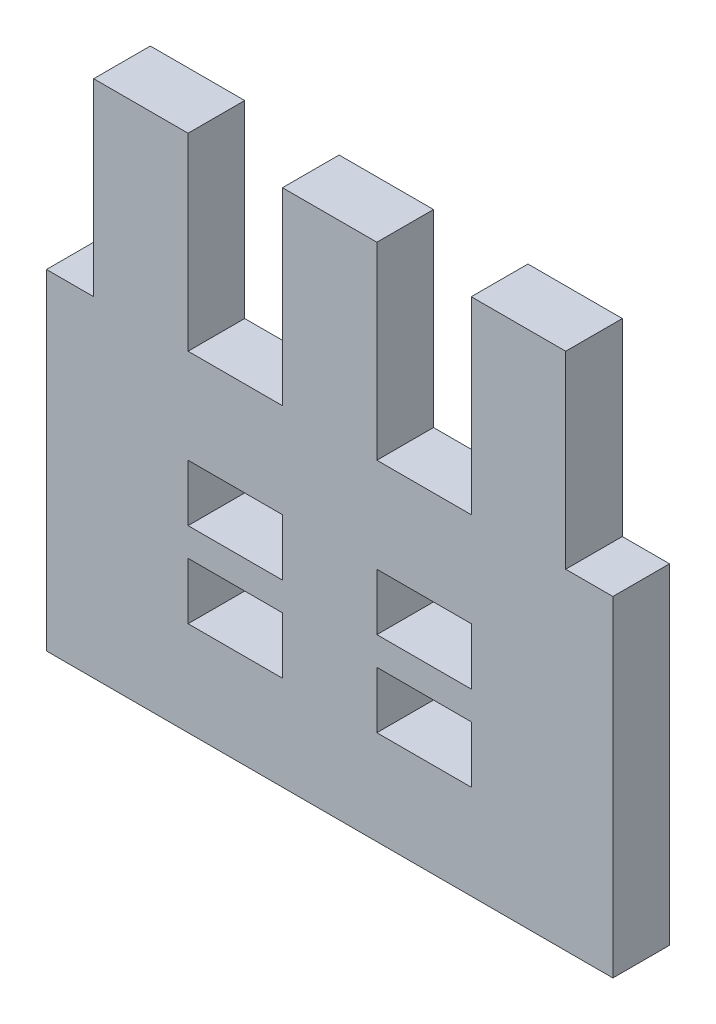
ISO-10303-21;
HEADER;
FILE_DESCRIPTION(('STEP AP214'),'2;1');
FILE_NAME('part.step','',(''),(''),'','','');
FILE_SCHEMA(('AUTOMOTIVE_DESIGN { 1 0 10303 214 1 1 1 1 }'));
ENDSEC;
DATA;
#1=APPLICATION_CONTEXT('core data for automotive mechanical design processes');
#2=APPLICATION_PROTOCOL_DEFINITION('international standard','automotive_design',2000,#1);
#3=PRODUCT_CONTEXT('',#1,'mechanical');
#4=PRODUCT('Part','Part','',(#3));
#5=PRODUCT_RELATED_PRODUCT_CATEGORY('part','',(#4));
#6=PRODUCT_DEFINITION_FORMATION('','',#4);
#7=PRODUCT_DEFINITION_CONTEXT('part definition',#1,'design');
#8=PRODUCT_DEFINITION('design','',#6,#7);
#9=PRODUCT_DEFINITION_SHAPE('','',#8);
#10=(LENGTH_UNIT() NAMED_UNIT(*) SI_UNIT(.MILLI.,.METRE.));
#11=(NAMED_UNIT(*) PLANE_ANGLE_UNIT() SI_UNIT($,.RADIAN.));
#12=(NAMED_UNIT(*) SI_UNIT($,.STERADIAN.) SOLID_ANGLE_UNIT());
#13=UNCERTAINTY_MEASURE_WITH_UNIT(LENGTH_MEASURE(1.E-05),#10,'distance_accuracy_value','');
#14=(GEOMETRIC_REPRESENTATION_CONTEXT(3) GLOBAL_UNCERTAINTY_ASSIGNED_CONTEXT((#13)) GLOBAL_UNIT_ASSIGNED_CONTEXT((#10,
#11,#12)) REPRESENTATION_CONTEXT('',''));
#15=CARTESIAN_POINT('',(0.,0.,0.));
#16=DIRECTION('',(0.,0.,1.));
#17=DIRECTION('',(1.,0.,0.));
#18=AXIS2_PLACEMENT_3D('',#15,#16,#17);
#19=CARTESIAN_POINT('',(0.,41.3725267472253,3.));
#20=DIRECTION('',(0.,1.,0.));
#21=DIRECTION('',(0.,0.,1.));
#22=AXIS2_PLACEMENT_3D('',#19,#20,#21);
#23=PLANE('',#22);
#24=DIRECTION('',(1.,0.,0.));
#25=VECTOR('',#24,1.);
#26=CARTESIAN_POINT('',(0.,41.3725267472253,0.));
#27=LINE('',#26,#25);
#28=CARTESIAN_POINT('',(-134.651475887316,41.3725267472253,0.));
#29=VERTEX_POINT('',#28);
#30=CARTESIAN_POINT('',(-132.151475887316,41.3725267472253,0.));
#31=VERTEX_POINT('',#30);
#32=EDGE_CURVE('E549',#29,#31,#27,.T.);
#33=ORIENTED_EDGE('',*,*,#32,.F.);
#34=DIRECTION('',(0.,0.,-1.));
#35=VECTOR('',#34,1.);
#36=CARTESIAN_POINT('',(-134.651475887316,41.3725267472253,3.));
#37=LINE('',#36,#35);
#38=CARTESIAN_POINT('',(-134.651475887316,41.3725267472253,3.));
#39=VERTEX_POINT('',#38);
#40=EDGE_CURVE('E45',#39,#29,#37,.T.);
#41=ORIENTED_EDGE('',*,*,#40,.F.);
#42=DIRECTION('',(1.,0.,0.));
#43=VECTOR('',#42,1.);
#44=CARTESIAN_POINT('',(0.,41.3725267472253,3.));
#45=LINE('',#44,#43);
#46=CARTESIAN_POINT('',(-132.151475887316,41.3725267472253,3.));
#47=VERTEX_POINT('',#46);
#48=EDGE_CURVE('E519',#39,#47,#45,.T.);
#49=ORIENTED_EDGE('',*,*,#48,.T.);
#50=DIRECTION('',(0.,0.,-1.));
#51=VECTOR('',#50,1.);
#52=CARTESIAN_POINT('',(-132.151475887316,41.3725267472253,3.));
#53=LINE('',#52,#51);
#54=EDGE_CURVE('E11',#47,#31,#53,.T.);
#55=ORIENTED_EDGE('',*,*,#54,.T.);
#56=EDGE_LOOP('',(#33,#41,#49,#55));
#57=FACE_BOUND('',#56,.T.);
#58=ADVANCED_FACE('F35',(#57),#23,.T.);
#59=CARTESIAN_POINT('',(-134.651475887316,0.,3.));
#60=DIRECTION('',(1.,0.,0.));
#61=DIRECTION('',(0.,0.,-1.));
#62=AXIS2_PLACEMENT_3D('',#59,#60,#61);
#63=PLANE('',#62);
#64=DIRECTION('',(0.,-1.,0.));
#65=VECTOR('',#64,1.);
#66=CARTESIAN_POINT('',(-134.651475887316,0.,0.));
#67=LINE('',#66,#65);
#68=CARTESIAN_POINT('',(-134.651475887316,23.8725267472253,0.));
#69=VERTEX_POINT('',#68);
#70=EDGE_CURVE('E552',#29,#69,#67,.T.);
#71=ORIENTED_EDGE('',*,*,#70,.T.);
#72=DIRECTION('',(0.,0.,-1.));
#73=VECTOR('',#72,1.);
#74=CARTESIAN_POINT('',(-134.651475887316,23.8725267472253,3.));
#75=LINE('',#74,#73);
#76=CARTESIAN_POINT('',(-134.651475887316,23.8725267472253,3.));
#77=VERTEX_POINT('',#76);
#78=EDGE_CURVE('E248',#77,#69,#75,.T.);
#79=ORIENTED_EDGE('',*,*,#78,.F.);
#80=DIRECTION('',(0.,-1.,0.));
#81=VECTOR('',#80,1.);
#82=CARTESIAN_POINT('',(-134.651475887316,0.,3.));
#83=LINE('',#82,#81);
#84=EDGE_CURVE('E508',#39,#77,#83,.T.);
#85=ORIENTED_EDGE('',*,*,#84,.F.);
#86=ORIENTED_EDGE('',*,*,#40,.T.);
#87=EDGE_LOOP('',(#71,#79,#85,#86));
#88=FACE_BOUND('',#87,.T.);
#89=ADVANCED_FACE('F400',(#88),#63,.F.);
#90=CARTESIAN_POINT('',(-127.151475887316,0.,3.));
#91=DIRECTION('',(1.,0.,0.));
#92=DIRECTION('',(0.,0.,-1.));
#93=AXIS2_PLACEMENT_3D('',#90,#91,#92);
#94=PLANE('',#93);
#95=DIRECTION('',(0.,-1.,0.));
#96=VECTOR('',#95,1.);
#97=CARTESIAN_POINT('',(-127.151475887316,0.,0.));
#98=LINE('',#97,#96);
#99=CARTESIAN_POINT('',(-127.151475887316,36.3725267472253,0.));
#100=VERTEX_POINT('',#99);
#101=CARTESIAN_POINT('',(-127.151475887316,33.3725267472253,0.));
#102=VERTEX_POINT('',#101);
#103=EDGE_CURVE('E280',#100,#102,#98,.T.);
#104=ORIENTED_EDGE('',*,*,#103,.F.);
#105=DIRECTION('',(0.,0.,-1.));
#106=VECTOR('',#105,1.);
#107=CARTESIAN_POINT('',(-127.151475887316,36.3725267472253,3.));
#108=LINE('',#107,#106);
#109=CARTESIAN_POINT('',(-127.151475887316,36.3725267472253,3.));
#110=VERTEX_POINT('',#109);
#111=EDGE_CURVE('E368',#110,#100,#108,.T.);
#112=ORIENTED_EDGE('',*,*,#111,.F.);
#113=DIRECTION('',(0.,-1.,0.));
#114=VECTOR('',#113,1.);
#115=CARTESIAN_POINT('',(-127.151475887316,0.,3.));
#116=LINE('',#115,#114);
#117=CARTESIAN_POINT('',(-127.151475887316,33.3725267472253,3.));
#118=VERTEX_POINT('',#117);
#119=EDGE_CURVE('E892',#110,#118,#116,.T.);
#120=ORIENTED_EDGE('',*,*,#119,.T.);
#121=DIRECTION('',(0.,0.,-1.));
#122=VECTOR('',#121,1.);
#123=CARTESIAN_POINT('',(-127.151475887316,33.3725267472253,3.));
#124=LINE('',#123,#122);
#125=EDGE_CURVE('E370',#118,#102,#124,.T.);
#126=ORIENTED_EDGE('',*,*,#125,.T.);
#127=EDGE_LOOP('',(#104,#112,#120,#126));
#128=FACE_BOUND('',#127,.T.);
#129=ADVANCED_FACE('F435',(#128),#94,.T.);
#130=CARTESIAN_POINT('',(0.,36.3725267472253,3.));
#131=DIRECTION('',(0.,1.,0.));
#132=DIRECTION('',(0.,0.,1.));
#133=AXIS2_PLACEMENT_3D('',#130,#131,#132);
#134=PLANE('',#133);
#135=DIRECTION('',(1.,0.,0.));
#136=VECTOR('',#135,1.);
#137=CARTESIAN_POINT('',(0.,36.3725267472253,0.));
#138=LINE('',#137,#136);
#139=CARTESIAN_POINT('',(-122.151475887316,36.3725267472253,0.));
#140=VERTEX_POINT('',#139);
#141=EDGE_CURVE('E294',#100,#140,#138,.T.);
#142=ORIENTED_EDGE('',*,*,#141,.T.);
#143=DIRECTION('',(0.,0.,-1.));
#144=VECTOR('',#143,1.);
#145=CARTESIAN_POINT('',(-122.151475887316,36.3725267472253,3.));
#146=LINE('',#145,#144);
#147=CARTESIAN_POINT('',(-122.151475887316,36.3725267472253,3.));
#148=VERTEX_POINT('',#147);
#149=EDGE_CURVE('E292',#148,#140,#146,.T.);
#150=ORIENTED_EDGE('',*,*,#149,.F.);
#151=DIRECTION('',(1.,0.,0.));
#152=VECTOR('',#151,1.);
#153=CARTESIAN_POINT('',(0.,36.3725267472253,3.));
#154=LINE('',#153,#152);
#155=EDGE_CURVE('E924',#110,#148,#154,.T.);
#156=ORIENTED_EDGE('',*,*,#155,.F.);
#157=ORIENTED_EDGE('',*,*,#111,.T.);
#158=EDGE_LOOP('',(#142,#150,#156,#157));
#159=FACE_BOUND('',#158,.T.);
#160=ADVANCED_FACE('F439',(#159),#134,.F.);
#161=CARTESIAN_POINT('',(-122.151475887316,0.,3.));
#162=DIRECTION('',(1.,0.,0.));
#163=DIRECTION('',(0.,0.,-1.));
#164=AXIS2_PLACEMENT_3D('',#161,#162,#163);
#165=PLANE('',#164);
#166=DIRECTION('',(0.,-1.,0.));
#167=VECTOR('',#166,1.);
#168=CARTESIAN_POINT('',(-122.151475887316,0.,0.));
#169=LINE('',#168,#167);
#170=CARTESIAN_POINT('',(-122.151475887316,33.3725267472253,0.));
#171=VERTEX_POINT('',#170);
#172=EDGE_CURVE('E278',#140,#171,#169,.T.);
#173=ORIENTED_EDGE('',*,*,#172,.T.);
#174=DIRECTION('',(0.,0.,-1.));
#175=VECTOR('',#174,1.);
#176=CARTESIAN_POINT('',(-122.151475887316,33.3725267472253,3.));
#177=LINE('',#176,#175);
#178=CARTESIAN_POINT('',(-122.151475887316,33.3725267472253,3.));
#179=VERTEX_POINT('',#178);
#180=EDGE_CURVE('E289',#179,#171,#177,.T.);
#181=ORIENTED_EDGE('',*,*,#180,.F.);
#182=DIRECTION('',(0.,-1.,0.));
#183=VECTOR('',#182,1.);
#184=CARTESIAN_POINT('',(-122.151475887316,0.,3.));
#185=LINE('',#184,#183);
#186=EDGE_CURVE('E925',#148,#179,#185,.T.);
#187=ORIENTED_EDGE('',*,*,#186,.F.);
#188=ORIENTED_EDGE('',*,*,#149,.T.);
#189=EDGE_LOOP('',(#173,#181,#187,#188));
#190=FACE_BOUND('',#189,.T.);
#191=ADVANCED_FACE('F286',(#190),#165,.F.);
#192=CARTESIAN_POINT('',(-117.151475887316,0.,3.));
#193=DIRECTION('',(1.,0.,0.));
#194=DIRECTION('',(0.,0.,-1.));
#195=AXIS2_PLACEMENT_3D('',#192,#193,#194);
#196=PLANE('',#195);
#197=DIRECTION('',(0.,-1.,0.));
#198=VECTOR('',#197,1.);
#199=CARTESIAN_POINT('',(-117.151475887316,0.,0.));
#200=LINE('',#199,#198);
#201=CARTESIAN_POINT('',(-117.151475887316,36.3725267472253,0.));
#202=VERTEX_POINT('',#201);
#203=CARTESIAN_POINT('',(-117.151475887316,33.3725267472253,0.));
#204=VERTEX_POINT('',#203);
#205=EDGE_CURVE('E293',#202,#204,#200,.T.);
#206=ORIENTED_EDGE('',*,*,#205,.F.);
#207=DIRECTION('',(0.,0.,-1.));
#208=VECTOR('',#207,1.);
#209=CARTESIAN_POINT('',(-117.151475887316,36.3725267472253,3.));
#210=LINE('',#209,#208);
#211=CARTESIAN_POINT('',(-117.151475887316,36.3725267472253,3.));
#212=VERTEX_POINT('',#211);
#213=EDGE_CURVE('E362',#212,#202,#210,.T.);
#214=ORIENTED_EDGE('',*,*,#213,.F.);
#215=DIRECTION('',(0.,-1.,0.));
#216=VECTOR('',#215,1.);
#217=CARTESIAN_POINT('',(-117.151475887316,0.,3.));
#218=LINE('',#217,#216);
#219=CARTESIAN_POINT('',(-117.151475887316,33.3725267472253,3.));
#220=VERTEX_POINT('',#219);
#221=EDGE_CURVE('E922',#212,#220,#218,.T.);
#222=ORIENTED_EDGE('',*,*,#221,.T.);
#223=DIRECTION('',(0.,0.,-1.));
#224=VECTOR('',#223,1.);
#225=CARTESIAN_POINT('',(-117.151475887316,33.3725267472253,3.));
#226=LINE('',#225,#224);
#227=EDGE_CURVE('E364',#220,#204,#226,.T.);
#228=ORIENTED_EDGE('',*,*,#227,.T.);
#229=EDGE_LOOP('',(#206,#214,#222,#228));
#230=FACE_BOUND('',#229,.T.);
#231=ADVANCED_FACE('F443',(#230),#196,.T.);
#232=CARTESIAN_POINT('',(-112.151475887316,36.3725267472253,0.));
#233=VERTEX_POINT('',#232);
#234=EDGE_CURVE('E296',#202,#233,#138,.T.);
#235=ORIENTED_EDGE('',*,*,#234,.T.);
#236=DIRECTION('',(0.,0.,-1.));
#237=VECTOR('',#236,1.);
#238=CARTESIAN_POINT('',(-112.151475887316,36.3725267472253,3.));
#239=LINE('',#238,#237);
#240=CARTESIAN_POINT('',(-112.151475887316,36.3725267472253,3.));
#241=VERTEX_POINT('',#240);
#242=EDGE_CURVE('E359',#241,#233,#239,.T.);
#243=ORIENTED_EDGE('',*,*,#242,.F.);
#244=EDGE_CURVE('E522',#212,#241,#154,.T.);
#245=ORIENTED_EDGE('',*,*,#244,.F.);
#246=ORIENTED_EDGE('',*,*,#213,.T.);
#247=EDGE_LOOP('',(#235,#243,#245,#246));
#248=FACE_BOUND('',#247,.T.);
#249=ADVANCED_FACE('F446',(#248),#134,.F.);
#250=CARTESIAN_POINT('',(-112.151475887316,0.,3.));
#251=DIRECTION('',(1.,0.,0.));
#252=DIRECTION('',(0.,0.,-1.));
#253=AXIS2_PLACEMENT_3D('',#250,#251,#252);
#254=PLANE('',#253);
#255=DIRECTION('',(0.,-1.,0.));
#256=VECTOR('',#255,1.);
#257=CARTESIAN_POINT('',(-112.151475887316,0.,0.));
#258=LINE('',#257,#256);
#259=CARTESIAN_POINT('',(-112.151475887316,33.3725267472253,0.));
#260=VERTEX_POINT('',#259);
#261=EDGE_CURVE('E301',#233,#260,#258,.T.);
#262=ORIENTED_EDGE('',*,*,#261,.T.);
#263=DIRECTION('',(0.,0.,-1.));
#264=VECTOR('',#263,1.);
#265=CARTESIAN_POINT('',(-112.151475887316,33.3725267472253,3.));
#266=LINE('',#265,#264);
#267=CARTESIAN_POINT('',(-112.151475887316,33.3725267472253,3.));
#268=VERTEX_POINT('',#267);
#269=EDGE_CURVE('E357',#268,#260,#266,.T.);
#270=ORIENTED_EDGE('',*,*,#269,.F.);
#271=DIRECTION('',(0.,-1.,0.));
#272=VECTOR('',#271,1.);
#273=CARTESIAN_POINT('',(-112.151475887316,0.,3.));
#274=LINE('',#273,#272);
#275=EDGE_CURVE('E515',#241,#268,#274,.T.);
#276=ORIENTED_EDGE('',*,*,#275,.F.);
#277=ORIENTED_EDGE('',*,*,#242,.T.);
#278=EDGE_LOOP('',(#262,#270,#276,#277));
#279=FACE_BOUND('',#278,.T.);
#280=ADVANCED_FACE('F448',(#279),#254,.F.);
#281=CARTESIAN_POINT('',(-104.651475887316,0.,3.));
#282=DIRECTION('',(1.,0.,0.));
#283=DIRECTION('',(0.,0.,-1.));
#284=AXIS2_PLACEMENT_3D('',#281,#282,#283);
#285=PLANE('',#284);
#286=DIRECTION('',(0.,-1.,0.));
#287=VECTOR('',#286,1.);
#288=CARTESIAN_POINT('',(-104.651475887316,0.,0.));
#289=LINE('',#288,#287);
#290=CARTESIAN_POINT('',(-104.651475887316,41.3725267472253,0.));
#291=VERTEX_POINT('',#290);
#292=CARTESIAN_POINT('',(-104.651475887316,23.8725267472253,0.));
#293=VERTEX_POINT('',#292);
#294=EDGE_CURVE('E303',#291,#293,#289,.T.);
#295=ORIENTED_EDGE('',*,*,#294,.F.);
#296=DIRECTION('',(0.,0.,-1.));
#297=VECTOR('',#296,1.);
#298=CARTESIAN_POINT('',(-104.651475887316,41.3725267472253,3.));
#299=LINE('',#298,#297);
#300=CARTESIAN_POINT('',(-104.651475887316,41.3725267472253,3.));
#301=VERTEX_POINT('',#300);
#302=EDGE_CURVE('E355',#301,#291,#299,.T.);
#303=ORIENTED_EDGE('',*,*,#302,.F.);
#304=DIRECTION('',(0.,-1.,0.));
#305=VECTOR('',#304,1.);
#306=CARTESIAN_POINT('',(-104.651475887316,0.,3.));
#307=LINE('',#306,#305);
#308=CARTESIAN_POINT('',(-104.651475887316,23.8725267472253,3.));
#309=VERTEX_POINT('',#308);
#310=EDGE_CURVE('E504',#301,#309,#307,.T.);
#311=ORIENTED_EDGE('',*,*,#310,.T.);
#312=DIRECTION('',(0.,0.,-1.));
#313=VECTOR('',#312,1.);
#314=CARTESIAN_POINT('',(-104.651475887316,23.8725267472253,3.));
#315=LINE('',#314,#313);
#316=EDGE_CURVE('E245',#309,#293,#315,.T.);
#317=ORIENTED_EDGE('',*,*,#316,.T.);
#318=EDGE_LOOP('',(#295,#303,#311,#317));
#319=FACE_BOUND('',#318,.T.);
#320=ADVANCED_FACE('F451',(#319),#285,.T.);
#321=CARTESIAN_POINT('',(-107.151475887316,41.3725267472253,0.));
#322=VERTEX_POINT('',#321);
#323=EDGE_CURVE('E305',#322,#291,#27,.T.);
#324=ORIENTED_EDGE('',*,*,#323,.F.);
#325=DIRECTION('',(0.,0.,-1.));
#326=VECTOR('',#325,1.);
#327=CARTESIAN_POINT('',(-107.151475887316,41.3725267472253,3.));
#328=LINE('',#327,#326);
#329=CARTESIAN_POINT('',(-107.151475887316,41.3725267472253,3.));
#330=VERTEX_POINT('',#329);
#331=EDGE_CURVE('E353',#330,#322,#328,.T.);
#332=ORIENTED_EDGE('',*,*,#331,.F.);
#333=EDGE_CURVE('E514',#330,#301,#45,.T.);
#334=ORIENTED_EDGE('',*,*,#333,.T.);
#335=ORIENTED_EDGE('',*,*,#302,.T.);
#336=EDGE_LOOP('',(#324,#332,#334,#335));
#337=FACE_BOUND('',#336,.T.);
#338=ADVANCED_FACE('F403',(#337),#23,.T.);
#339=CARTESIAN_POINT('',(-107.151475887316,0.,3.));
#340=DIRECTION('',(-1.,0.,0.));
#341=DIRECTION('',(0.,0.,1.));
#342=AXIS2_PLACEMENT_3D('',#339,#340,#341);
#343=PLANE('',#342);
#344=DIRECTION('',(0.,1.,0.));
#345=VECTOR('',#344,1.);
#346=CARTESIAN_POINT('',(-107.151475887316,0.,0.));
#347=LINE('',#346,#345);
#348=CARTESIAN_POINT('',(-107.151475887316,51.3725267472253,0.));
#349=VERTEX_POINT('',#348);
#350=EDGE_CURVE('E306',#322,#349,#347,.T.);
#351=ORIENTED_EDGE('',*,*,#350,.T.);
#352=DIRECTION('',(0.,0.,-1.));
#353=VECTOR('',#352,1.);
#354=CARTESIAN_POINT('',(-107.151475887316,51.3725267472253,3.));
#355=LINE('',#354,#353);
#356=CARTESIAN_POINT('',(-107.151475887316,51.3725267472253,3.));
#357=VERTEX_POINT('',#356);
#358=EDGE_CURVE('E351',#357,#349,#355,.T.);
#359=ORIENTED_EDGE('',*,*,#358,.F.);
#360=DIRECTION('',(0.,1.,0.));
#361=VECTOR('',#360,1.);
#362=CARTESIAN_POINT('',(-107.151475887316,0.,3.));
#363=LINE('',#362,#361);
#364=EDGE_CURVE('E517',#330,#357,#363,.T.);
#365=ORIENTED_EDGE('',*,*,#364,.F.);
#366=ORIENTED_EDGE('',*,*,#331,.T.);
#367=EDGE_LOOP('',(#351,#359,#365,#366));
#368=FACE_BOUND('',#367,.T.);
#369=ADVANCED_FACE('F459',(#368),#343,.F.);
#370=CARTESIAN_POINT('',(0.,51.3725267472253,3.));
#371=DIRECTION('',(0.,1.,0.));
#372=DIRECTION('',(0.,0.,1.));
#373=AXIS2_PLACEMENT_3D('',#370,#371,#372);
#374=PLANE('',#373);
#375=DIRECTION('',(1.,0.,0.));
#376=VECTOR('',#375,1.);
#377=CARTESIAN_POINT('',(0.,51.3725267472253,0.));
#378=LINE('',#377,#376);
#379=CARTESIAN_POINT('',(-112.151475887316,51.3725267472253,0.));
#380=VERTEX_POINT('',#379);
#381=EDGE_CURVE('E309',#380,#349,#378,.T.);
#382=ORIENTED_EDGE('',*,*,#381,.F.);
#383=DIRECTION('',(0.,0.,-1.));
#384=VECTOR('',#383,1.);
#385=CARTESIAN_POINT('',(-112.151475887316,51.3725267472253,3.));
#386=LINE('',#385,#384);
#387=CARTESIAN_POINT('',(-112.151475887316,51.3725267472253,3.));
#388=VERTEX_POINT('',#387);
#389=EDGE_CURVE('E349',#388,#380,#386,.T.);
#390=ORIENTED_EDGE('',*,*,#389,.F.);
#391=DIRECTION('',(1.,0.,0.));
#392=VECTOR('',#391,1.);
#393=CARTESIAN_POINT('',(0.,51.3725267472253,3.));
#394=LINE('',#393,#392);
#395=EDGE_CURVE('E528',#388,#357,#394,.T.);
#396=ORIENTED_EDGE('',*,*,#395,.T.);
#397=ORIENTED_EDGE('',*,*,#358,.T.);
#398=EDGE_LOOP('',(#382,#390,#396,#397));
#399=FACE_BOUND('',#398,.T.);
#400=ADVANCED_FACE('F462',(#399),#374,.T.);
#401=CARTESIAN_POINT('',(-112.151475887317,3.1128287693948E-13,3.));
#402=DIRECTION('',(-1.,0.,0.));
#403=DIRECTION('',(0.,-1.,0.));
#404=AXIS2_PLACEMENT_3D('',#401,#402,#403);
#405=PLANE('',#404);
#406=DIRECTION('',(0.,1.,0.));
#407=VECTOR('',#406,1.);
#408=CARTESIAN_POINT('',(-112.151475887317,3.1128287693948E-13,0.));
#409=LINE('',#408,#407);
#410=CARTESIAN_POINT('',(-112.151475887316,41.3725267472253,0.));
#411=VERTEX_POINT('',#410);
#412=EDGE_CURVE('E312',#411,#380,#409,.T.);
#413=ORIENTED_EDGE('',*,*,#412,.F.);
#414=DIRECTION('',(0.,0.,-1.));
#415=VECTOR('',#414,1.);
#416=CARTESIAN_POINT('',(-112.151475887316,41.3725267472253,3.));
#417=LINE('',#416,#415);
#418=CARTESIAN_POINT('',(-112.151475887316,41.3725267472253,3.));
#419=VERTEX_POINT('',#418);
#420=EDGE_CURVE('E347',#419,#411,#417,.T.);
#421=ORIENTED_EDGE('',*,*,#420,.F.);
#422=DIRECTION('',(0.,1.,0.));
#423=VECTOR('',#422,1.);
#424=CARTESIAN_POINT('',(-112.151475887317,3.1128287693948E-13,3.));
#425=LINE('',#424,#423);
#426=EDGE_CURVE('E531',#419,#388,#425,.T.);
#427=ORIENTED_EDGE('',*,*,#426,.T.);
#428=ORIENTED_EDGE('',*,*,#389,.T.);
#429=EDGE_LOOP('',(#413,#421,#427,#428));
#430=FACE_BOUND('',#429,.T.);
#431=ADVANCED_FACE('F466',(#430),#405,.T.);
#432=CARTESIAN_POINT('',(-117.151475887316,41.3725267472253,0.));
#433=VERTEX_POINT('',#432);
#434=EDGE_CURVE('E315',#433,#411,#27,.T.);
#435=ORIENTED_EDGE('',*,*,#434,.F.);
#436=DIRECTION('',(0.,0.,-1.));
#437=VECTOR('',#436,1.);
#438=CARTESIAN_POINT('',(-117.151475887316,41.3725267472253,3.));
#439=LINE('',#438,#437);
#440=CARTESIAN_POINT('',(-117.151475887316,41.3725267472253,3.));
#441=VERTEX_POINT('',#440);
#442=EDGE_CURVE('E345',#441,#433,#439,.T.);
#443=ORIENTED_EDGE('',*,*,#442,.F.);
#444=EDGE_CURVE('E520',#441,#419,#45,.T.);
#445=ORIENTED_EDGE('',*,*,#444,.T.);
#446=ORIENTED_EDGE('',*,*,#420,.T.);
#447=EDGE_LOOP('',(#435,#443,#445,#446));
#448=FACE_BOUND('',#447,.T.);
#449=ADVANCED_FACE('F470',(#448),#23,.T.);
#450=CARTESIAN_POINT('',(-117.151475887316,0.,3.));
#451=DIRECTION('',(-1.,0.,0.));
#452=DIRECTION('',(0.,0.,1.));
#453=AXIS2_PLACEMENT_3D('',#450,#451,#452);
#454=PLANE('',#453);
#455=DIRECTION('',(0.,1.,0.));
#456=VECTOR('',#455,1.);
#457=CARTESIAN_POINT('',(-117.151475887316,0.,0.));
#458=LINE('',#457,#456);
#459=CARTESIAN_POINT('',(-117.151475887316,51.3725267472253,0.));
#460=VERTEX_POINT('',#459);
#461=EDGE_CURVE('E316',#433,#460,#458,.T.);
#462=ORIENTED_EDGE('',*,*,#461,.T.);
#463=DIRECTION('',(0.,0.,-1.));
#464=VECTOR('',#463,1.);
#465=CARTESIAN_POINT('',(-117.151475887316,51.3725267472253,3.));
#466=LINE('',#465,#464);
#467=CARTESIAN_POINT('',(-117.151475887316,51.3725267472253,3.));
#468=VERTEX_POINT('',#467);
#469=EDGE_CURVE('E343',#468,#460,#466,.T.);
#470=ORIENTED_EDGE('',*,*,#469,.F.);
#471=DIRECTION('',(0.,1.,0.));
#472=VECTOR('',#471,1.);
#473=CARTESIAN_POINT('',(-117.151475887316,0.,3.));
#474=LINE('',#473,#472);
#475=EDGE_CURVE('E534',#441,#468,#474,.T.);
#476=ORIENTED_EDGE('',*,*,#475,.F.);
#477=ORIENTED_EDGE('',*,*,#442,.T.);
#478=EDGE_LOOP('',(#462,#470,#476,#477));
#479=FACE_BOUND('',#478,.T.);
#480=ADVANCED_FACE('F472',(#479),#454,.F.);
#481=CARTESIAN_POINT('',(0.,51.3725267472253,3.));
#482=DIRECTION('',(0.,1.,0.));
#483=DIRECTION('',(0.,0.,1.));
#484=AXIS2_PLACEMENT_3D('',#481,#482,#483);
#485=PLANE('',#484);
#486=DIRECTION('',(1.,0.,0.));
#487=VECTOR('',#486,1.);
#488=CARTESIAN_POINT('',(0.,51.3725267472253,0.));
#489=LINE('',#488,#487);
#490=CARTESIAN_POINT('',(-122.151475887316,51.3725267472253,0.));
#491=VERTEX_POINT('',#490);
#492=EDGE_CURVE('E319',#491,#460,#489,.T.);
#493=ORIENTED_EDGE('',*,*,#492,.F.);
#494=DIRECTION('',(0.,0.,-1.));
#495=VECTOR('',#494,1.);
#496=CARTESIAN_POINT('',(-122.151475887316,51.3725267472253,3.));
#497=LINE('',#496,#495);
#498=CARTESIAN_POINT('',(-122.151475887316,51.3725267472253,3.));
#499=VERTEX_POINT('',#498);
#500=EDGE_CURVE('E341',#499,#491,#497,.T.);
#501=ORIENTED_EDGE('',*,*,#500,.F.);
#502=DIRECTION('',(1.,0.,0.));
#503=VECTOR('',#502,1.);
#504=CARTESIAN_POINT('',(0.,51.3725267472253,3.));
#505=LINE('',#504,#503);
#506=EDGE_CURVE('E537',#499,#468,#505,.T.);
#507=ORIENTED_EDGE('',*,*,#506,.T.);
#508=ORIENTED_EDGE('',*,*,#469,.T.);
#509=EDGE_LOOP('',(#493,#501,#507,#508));
#510=FACE_BOUND('',#509,.T.);
#511=ADVANCED_FACE('F475',(#510),#485,.T.);
#512=CARTESIAN_POINT('',(-122.151475887317,3.39038452555109E-13,3.));
#513=DIRECTION('',(-1.,0.,0.));
#514=DIRECTION('',(0.,-1.,0.));
#515=AXIS2_PLACEMENT_3D('',#512,#513,#514);
#516=PLANE('',#515);
#517=DIRECTION('',(0.,1.,0.));
#518=VECTOR('',#517,1.);
#519=CARTESIAN_POINT('',(-122.151475887317,3.39038452555109E-13,0.));
#520=LINE('',#519,#518);
#521=CARTESIAN_POINT('',(-122.151475887316,41.3725267472253,0.));
#522=VERTEX_POINT('',#521);
#523=EDGE_CURVE('E322',#522,#491,#520,.T.);
#524=ORIENTED_EDGE('',*,*,#523,.F.);
#525=DIRECTION('',(0.,0.,-1.));
#526=VECTOR('',#525,1.);
#527=CARTESIAN_POINT('',(-122.151475887316,41.3725267472253,3.));
#528=LINE('',#527,#526);
#529=CARTESIAN_POINT('',(-122.151475887316,41.3725267472253,3.));
#530=VERTEX_POINT('',#529);
#531=EDGE_CURVE('E339',#530,#522,#528,.T.);
#532=ORIENTED_EDGE('',*,*,#531,.F.);
#533=DIRECTION('',(0.,1.,0.));
#534=VECTOR('',#533,1.);
#535=CARTESIAN_POINT('',(-122.151475887317,3.39038452555109E-13,3.));
#536=LINE('',#535,#534);
#537=EDGE_CURVE('E540',#530,#499,#536,.T.);
#538=ORIENTED_EDGE('',*,*,#537,.T.);
#539=ORIENTED_EDGE('',*,*,#500,.T.);
#540=EDGE_LOOP('',(#524,#532,#538,#539));
#541=FACE_BOUND('',#540,.T.);
#542=ADVANCED_FACE('F479',(#541),#516,.T.);
#543=CARTESIAN_POINT('',(-127.151475887316,41.3725267472253,0.));
#544=VERTEX_POINT('',#543);
#545=EDGE_CURVE('E325',#544,#522,#27,.T.);
#546=ORIENTED_EDGE('',*,*,#545,.F.);
#547=DIRECTION('',(0.,0.,-1.));
#548=VECTOR('',#547,1.);
#549=CARTESIAN_POINT('',(-127.151475887316,41.3725267472253,3.));
#550=LINE('',#549,#548);
#551=CARTESIAN_POINT('',(-127.151475887316,41.3725267472253,3.));
#552=VERTEX_POINT('',#551);
#553=EDGE_CURVE('E337',#552,#544,#550,.T.);
#554=ORIENTED_EDGE('',*,*,#553,.F.);
#555=EDGE_CURVE('E543',#552,#530,#45,.T.);
#556=ORIENTED_EDGE('',*,*,#555,.T.);
#557=ORIENTED_EDGE('',*,*,#531,.T.);
#558=EDGE_LOOP('',(#546,#554,#556,#557));
#559=FACE_BOUND('',#558,.T.);
#560=ADVANCED_FACE('F404',(#559),#23,.T.);
#561=CARTESIAN_POINT('',(-127.151475887316,0.,3.));
#562=DIRECTION('',(-1.,0.,0.));
#563=DIRECTION('',(0.,0.,1.));
#564=AXIS2_PLACEMENT_3D('',#561,#562,#563);
#565=PLANE('',#564);
#566=DIRECTION('',(0.,1.,0.));
#567=VECTOR('',#566,1.);
#568=CARTESIAN_POINT('',(-127.151475887316,0.,0.));
#569=LINE('',#568,#567);
#570=CARTESIAN_POINT('',(-127.151475887316,51.3725267472253,0.));
#571=VERTEX_POINT('',#570);
#572=EDGE_CURVE('E326',#544,#571,#569,.T.);
#573=ORIENTED_EDGE('',*,*,#572,.T.);
#574=DIRECTION('',(0.,0.,-1.));
#575=VECTOR('',#574,1.);
#576=CARTESIAN_POINT('',(-127.151475887316,51.3725267472253,3.));
#577=LINE('',#576,#575);
#578=CARTESIAN_POINT('',(-127.151475887316,51.3725267472253,3.));
#579=VERTEX_POINT('',#578);
#580=EDGE_CURVE('E334',#579,#571,#577,.T.);
#581=ORIENTED_EDGE('',*,*,#580,.F.);
#582=DIRECTION('',(0.,1.,0.));
#583=VECTOR('',#582,1.);
#584=CARTESIAN_POINT('',(-127.151475887316,0.,3.));
#585=LINE('',#584,#583);
#586=EDGE_CURVE('E544',#552,#579,#585,.T.);
#587=ORIENTED_EDGE('',*,*,#586,.F.);
#588=ORIENTED_EDGE('',*,*,#553,.T.);
#589=EDGE_LOOP('',(#573,#581,#587,#588));
#590=FACE_BOUND('',#589,.T.);
#591=ADVANCED_FACE('F485',(#590),#565,.F.);
#592=CARTESIAN_POINT('',(0.,51.3725267472253,3.));
#593=DIRECTION('',(0.,1.,0.));
#594=DIRECTION('',(0.,0.,1.));
#595=AXIS2_PLACEMENT_3D('',#592,#593,#594);
#596=PLANE('',#595);
#597=DIRECTION('',(1.,0.,0.));
#598=VECTOR('',#597,1.);
#599=CARTESIAN_POINT('',(0.,51.3725267472253,0.));
#600=LINE('',#599,#598);
#601=CARTESIAN_POINT('',(-132.151475887316,51.3725267472253,0.));
#602=VERTEX_POINT('',#601);
#603=EDGE_CURVE('E329',#602,#571,#600,.T.);
#604=ORIENTED_EDGE('',*,*,#603,.F.);
#605=DIRECTION('',(0.,0.,-1.));
#606=VECTOR('',#605,1.);
#607=CARTESIAN_POINT('',(-132.151475887316,51.3725267472253,3.));
#608=LINE('',#607,#606);
#609=CARTESIAN_POINT('',(-132.151475887316,51.3725267472253,3.));
#610=VERTEX_POINT('',#609);
#611=EDGE_CURVE('E54',#610,#602,#608,.T.);
#612=ORIENTED_EDGE('',*,*,#611,.F.);
#613=DIRECTION('',(1.,0.,0.));
#614=VECTOR('',#613,1.);
#615=CARTESIAN_POINT('',(0.,51.3725267472253,3.));
#616=LINE('',#615,#614);
#617=EDGE_CURVE('E335',#610,#579,#616,.T.);
#618=ORIENTED_EDGE('',*,*,#617,.T.);
#619=ORIENTED_EDGE('',*,*,#580,.T.);
#620=EDGE_LOOP('',(#604,#612,#618,#619));
#621=FACE_BOUND('',#620,.T.);
#622=ADVANCED_FACE('F431',(#621),#596,.T.);
#623=CARTESIAN_POINT('',(-132.151475887317,3.66794028170738E-13,3.));
#624=DIRECTION('',(-1.,0.,0.));
#625=DIRECTION('',(0.,-1.,0.));
#626=AXIS2_PLACEMENT_3D('',#623,#624,#625);
#627=PLANE('',#626);
#628=DIRECTION('',(0.,1.,0.));
#629=VECTOR('',#628,1.);
#630=CARTESIAN_POINT('',(-132.151475887317,3.66794028170738E-13,0.));
#631=LINE('',#630,#629);
#632=EDGE_CURVE('E253',#31,#602,#631,.T.);
#633=ORIENTED_EDGE('',*,*,#632,.F.);
#634=ORIENTED_EDGE('',*,*,#54,.F.);
#635=DIRECTION('',(0.,1.,0.));
#636=VECTOR('',#635,1.);
#637=CARTESIAN_POINT('',(-132.151475887317,3.66794028170738E-13,3.));
#638=LINE('',#637,#636);
#639=EDGE_CURVE('E332',#47,#610,#638,.T.);
#640=ORIENTED_EDGE('',*,*,#639,.T.);
#641=ORIENTED_EDGE('',*,*,#611,.T.);
#642=EDGE_LOOP('',(#633,#634,#640,#641));
#643=FACE_BOUND('',#642,.T.);
#644=ADVANCED_FACE('F428',(#643),#627,.T.);
#645=CARTESIAN_POINT('',(0.,0.,0.));
#646=DIRECTION('',(0.,0.,1.));
#647=DIRECTION('',(1.,0.,0.));
#648=AXIS2_PLACEMENT_3D('',#645,#646,#647);
#649=PLANE('',#648);
#650=ORIENTED_EDGE('',*,*,#294,.T.);
#651=DIRECTION('',(1.,0.,0.));
#652=VECTOR('',#651,1.);
#653=CARTESIAN_POINT('',(0.,23.8725267472253,0.));
#654=LINE('',#653,#652);
#655=EDGE_CURVE('E209',#69,#293,#654,.T.);
#656=ORIENTED_EDGE('',*,*,#655,.F.);
#657=ORIENTED_EDGE('',*,*,#70,.F.);
#658=ORIENTED_EDGE('',*,*,#32,.T.);
#659=ORIENTED_EDGE('',*,*,#632,.T.);
#660=ORIENTED_EDGE('',*,*,#603,.T.);
#661=ORIENTED_EDGE('',*,*,#572,.F.);
#662=ORIENTED_EDGE('',*,*,#545,.T.);
#663=ORIENTED_EDGE('',*,*,#523,.T.);
#664=ORIENTED_EDGE('',*,*,#492,.T.);
#665=ORIENTED_EDGE('',*,*,#461,.F.);
#666=ORIENTED_EDGE('',*,*,#434,.T.);
#667=ORIENTED_EDGE('',*,*,#412,.T.);
#668=ORIENTED_EDGE('',*,*,#381,.T.);
#669=ORIENTED_EDGE('',*,*,#350,.F.);
#670=ORIENTED_EDGE('',*,*,#323,.T.);
#671=EDGE_LOOP('',(#650,#656,#657,#658,#659,#660,#661,#662,#663,#664,#665,#666,#667,#668,#669,#670));
#672=FACE_BOUND('',#671,.T.);
#673=DIRECTION('',(1.,0.,0.));
#674=VECTOR('',#673,1.);
#675=CARTESIAN_POINT('',(-134.651475887316,31.8725267472253,0.));
#676=LINE('',#675,#674);
#677=CARTESIAN_POINT('',(-127.151475887316,31.8725267472253,0.));
#678=VERTEX_POINT('',#677);
#679=CARTESIAN_POINT('',(-122.151475887316,31.8725267472253,0.));
#680=VERTEX_POINT('',#679);
#681=EDGE_CURVE('E208',#678,#680,#676,.T.);
#682=ORIENTED_EDGE('',*,*,#681,.F.);
#683=DIRECTION('',(0.,-1.,0.));
#684=VECTOR('',#683,1.);
#685=CARTESIAN_POINT('',(-127.151475887316,0.,0.));
#686=LINE('',#685,#684);
#687=CARTESIAN_POINT('',(-127.151475887316,28.8725267472253,0.));
#688=VERTEX_POINT('',#687);
#689=EDGE_CURVE('E194',#678,#688,#686,.T.);
#690=ORIENTED_EDGE('',*,*,#689,.T.);
#691=DIRECTION('',(1.,0.,0.));
#692=VECTOR('',#691,1.);
#693=CARTESIAN_POINT('',(0.,28.8725267472253,0.));
#694=LINE('',#693,#692);
#695=CARTESIAN_POINT('',(-122.151475887316,28.8725267472253,0.));
#696=VERTEX_POINT('',#695);
#697=EDGE_CURVE('E206',#688,#696,#694,.T.);
#698=ORIENTED_EDGE('',*,*,#697,.T.);
#699=DIRECTION('',(0.,-1.,0.));
#700=VECTOR('',#699,1.);
#701=CARTESIAN_POINT('',(-122.151475887316,0.,0.));
#702=LINE('',#701,#700);
#703=EDGE_CURVE('E213',#680,#696,#702,.T.);
#704=ORIENTED_EDGE('',*,*,#703,.F.);
#705=EDGE_LOOP('',(#682,#690,#698,#704));
#706=FACE_BOUND('',#705,.T.);
#707=ORIENTED_EDGE('',*,*,#103,.T.);
#708=DIRECTION('',(1.,0.,0.));
#709=VECTOR('',#708,1.);
#710=CARTESIAN_POINT('',(-134.651475887316,33.3725267472253,0.));
#711=LINE('',#710,#709);
#712=EDGE_CURVE('E258',#102,#171,#711,.T.);
#713=ORIENTED_EDGE('',*,*,#712,.T.);
#714=ORIENTED_EDGE('',*,*,#172,.F.);
#715=ORIENTED_EDGE('',*,*,#141,.F.);
#716=EDGE_LOOP('',(#707,#713,#714,#715));
#717=FACE_BOUND('',#716,.T.);
#718=ORIENTED_EDGE('',*,*,#205,.T.);
#719=EDGE_CURVE('E39',#204,#260,#711,.T.);
#720=ORIENTED_EDGE('',*,*,#719,.T.);
#721=ORIENTED_EDGE('',*,*,#261,.F.);
#722=ORIENTED_EDGE('',*,*,#234,.F.);
#723=EDGE_LOOP('',(#718,#720,#721,#722));
#724=FACE_BOUND('',#723,.T.);
#725=DIRECTION('',(0.,-1.,0.));
#726=VECTOR('',#725,1.);
#727=CARTESIAN_POINT('',(-112.151475887316,0.,0.));
#728=LINE('',#727,#726);
#729=CARTESIAN_POINT('',(-112.151475887316,31.8725267472253,0.));
#730=VERTEX_POINT('',#729);
#731=CARTESIAN_POINT('',(-112.151475887316,28.8725267472253,0.));
#732=VERTEX_POINT('',#731);
#733=EDGE_CURVE('E222',#730,#732,#728,.T.);
#734=ORIENTED_EDGE('',*,*,#733,.F.);
#735=CARTESIAN_POINT('',(-117.151475887316,31.8725267472253,0.));
#736=VERTEX_POINT('',#735);
#737=EDGE_CURVE('E261',#736,#730,#676,.T.);
#738=ORIENTED_EDGE('',*,*,#737,.F.);
#739=DIRECTION('',(0.,-1.,0.));
#740=VECTOR('',#739,1.);
#741=CARTESIAN_POINT('',(-117.151475887316,0.,0.));
#742=LINE('',#741,#740);
#743=CARTESIAN_POINT('',(-117.151475887316,28.8725267472253,0.));
#744=VERTEX_POINT('',#743);
#745=EDGE_CURVE('E218',#736,#744,#742,.T.);
#746=ORIENTED_EDGE('',*,*,#745,.T.);
#747=EDGE_CURVE('E215',#744,#732,#694,.T.);
#748=ORIENTED_EDGE('',*,*,#747,.T.);
#749=EDGE_LOOP('',(#734,#738,#746,#748));
#750=FACE_BOUND('',#749,.T.);
#751=ADVANCED_FACE('F203',(#672,#706,#717,#724,#750),#649,.F.);
#752=CARTESIAN_POINT('',(0.,0.,3.));
#753=DIRECTION('',(0.,0.,1.));
#754=DIRECTION('',(1.,0.,0.));
#755=AXIS2_PLACEMENT_3D('',#752,#753,#754);
#756=PLANE('',#755);
#757=DIRECTION('',(1.,0.,0.));
#758=VECTOR('',#757,1.);
#759=CARTESIAN_POINT('',(0.,23.8725267472253,3.));
#760=LINE('',#759,#758);
#761=EDGE_CURVE('E216',#77,#309,#760,.T.);
#762=ORIENTED_EDGE('',*,*,#761,.T.);
#763=ORIENTED_EDGE('',*,*,#310,.F.);
#764=ORIENTED_EDGE('',*,*,#333,.F.);
#765=ORIENTED_EDGE('',*,*,#364,.T.);
#766=ORIENTED_EDGE('',*,*,#395,.F.);
#767=ORIENTED_EDGE('',*,*,#426,.F.);
#768=ORIENTED_EDGE('',*,*,#444,.F.);
#769=ORIENTED_EDGE('',*,*,#475,.T.);
#770=ORIENTED_EDGE('',*,*,#506,.F.);
#771=ORIENTED_EDGE('',*,*,#537,.F.);
#772=ORIENTED_EDGE('',*,*,#555,.F.);
#773=ORIENTED_EDGE('',*,*,#586,.T.);
#774=ORIENTED_EDGE('',*,*,#617,.F.);
#775=ORIENTED_EDGE('',*,*,#639,.F.);
#776=ORIENTED_EDGE('',*,*,#48,.F.);
#777=ORIENTED_EDGE('',*,*,#84,.T.);
#778=EDGE_LOOP('',(#762,#763,#764,#765,#766,#767,#768,#769,#770,#771,#772,#773,#774,#775,#776,#777));
#779=FACE_BOUND('',#778,.T.);
#780=DIRECTION('',(0.,-1.,0.));
#781=VECTOR('',#780,1.);
#782=CARTESIAN_POINT('',(-127.151475887316,0.,3.));
#783=LINE('',#782,#781);
#784=CARTESIAN_POINT('',(-127.151475887316,31.8725267472253,3.));
#785=VERTEX_POINT('',#784);
#786=CARTESIAN_POINT('',(-127.151475887316,28.8725267472253,3.));
#787=VERTEX_POINT('',#786);
#788=EDGE_CURVE('E196',#785,#787,#783,.T.);
#789=ORIENTED_EDGE('',*,*,#788,.F.);
#790=DIRECTION('',(1.,0.,0.));
#791=VECTOR('',#790,1.);
#792=CARTESIAN_POINT('',(-134.651475887316,31.8725267472253,3.));
#793=LINE('',#792,#791);
#794=CARTESIAN_POINT('',(-122.151475887316,31.8725267472253,3.));
#795=VERTEX_POINT('',#794);
#796=EDGE_CURVE('E257',#785,#795,#793,.T.);
#797=ORIENTED_EDGE('',*,*,#796,.T.);
#798=DIRECTION('',(0.,-1.,0.));
#799=VECTOR('',#798,1.);
#800=CARTESIAN_POINT('',(-122.151475887316,0.,3.));
#801=LINE('',#800,#799);
#802=CARTESIAN_POINT('',(-122.151475887316,28.8725267472253,3.));
#803=VERTEX_POINT('',#802);
#804=EDGE_CURVE('E374',#795,#803,#801,.T.);
#805=ORIENTED_EDGE('',*,*,#804,.T.);
#806=DIRECTION('',(1.,0.,0.));
#807=VECTOR('',#806,1.);
#808=CARTESIAN_POINT('',(0.,28.8725267472253,3.));
#809=LINE('',#808,#807);
#810=EDGE_CURVE('E198',#787,#803,#809,.T.);
#811=ORIENTED_EDGE('',*,*,#810,.F.);
#812=EDGE_LOOP('',(#789,#797,#805,#811));
#813=FACE_BOUND('',#812,.T.);
#814=DIRECTION('',(1.,0.,0.));
#815=VECTOR('',#814,1.);
#816=CARTESIAN_POINT('',(-134.651475887316,33.3725267472253,3.));
#817=LINE('',#816,#815);
#818=EDGE_CURVE('E210',#118,#179,#817,.T.);
#819=ORIENTED_EDGE('',*,*,#818,.F.);
#820=ORIENTED_EDGE('',*,*,#119,.F.);
#821=ORIENTED_EDGE('',*,*,#155,.T.);
#822=ORIENTED_EDGE('',*,*,#186,.T.);
#823=EDGE_LOOP('',(#819,#820,#821,#822));
#824=FACE_BOUND('',#823,.T.);
#825=EDGE_CURVE('E259',#220,#268,#817,.T.);
#826=ORIENTED_EDGE('',*,*,#825,.F.);
#827=ORIENTED_EDGE('',*,*,#221,.F.);
#828=ORIENTED_EDGE('',*,*,#244,.T.);
#829=ORIENTED_EDGE('',*,*,#275,.T.);
#830=EDGE_LOOP('',(#826,#827,#828,#829));
#831=FACE_BOUND('',#830,.T.);
#832=CARTESIAN_POINT('',(-117.151475887316,31.8725267472253,3.));
#833=VERTEX_POINT('',#832);
#834=CARTESIAN_POINT('',(-112.151475887316,31.8725267472253,3.));
#835=VERTEX_POINT('',#834);
#836=EDGE_CURVE('E254',#833,#835,#793,.T.);
#837=ORIENTED_EDGE('',*,*,#836,.T.);
#838=DIRECTION('',(0.,-1.,0.));
#839=VECTOR('',#838,1.);
#840=CARTESIAN_POINT('',(-112.151475887316,0.,3.));
#841=LINE('',#840,#839);
#842=CARTESIAN_POINT('',(-112.151475887316,28.8725267472253,3.));
#843=VERTEX_POINT('',#842);
#844=EDGE_CURVE('E378',#835,#843,#841,.T.);
#845=ORIENTED_EDGE('',*,*,#844,.T.);
#846=CARTESIAN_POINT('',(-117.151475887316,28.8725267472253,3.));
#847=VERTEX_POINT('',#846);
#848=EDGE_CURVE('E375',#847,#843,#809,.T.);
#849=ORIENTED_EDGE('',*,*,#848,.F.);
#850=DIRECTION('',(0.,-1.,0.));
#851=VECTOR('',#850,1.);
#852=CARTESIAN_POINT('',(-117.151475887316,0.,3.));
#853=LINE('',#852,#851);
#854=EDGE_CURVE('E380',#833,#847,#853,.T.);
#855=ORIENTED_EDGE('',*,*,#854,.F.);
#856=EDGE_LOOP('',(#837,#845,#849,#855));
#857=FACE_BOUND('',#856,.T.);
#858=ADVANCED_FACE('F386',(#779,#813,#824,#831,#857),#756,.T.);
#859=CARTESIAN_POINT('',(0.,23.8725267472253,3.));
#860=DIRECTION('',(0.,1.,0.));
#861=DIRECTION('',(0.,0.,1.));
#862=AXIS2_PLACEMENT_3D('',#859,#860,#861);
#863=PLANE('',#862);
#864=ORIENTED_EDGE('',*,*,#655,.T.);
#865=ORIENTED_EDGE('',*,*,#316,.F.);
#866=ORIENTED_EDGE('',*,*,#761,.F.);
#867=ORIENTED_EDGE('',*,*,#78,.T.);
#868=EDGE_LOOP('',(#864,#865,#866,#867));
#869=FACE_BOUND('',#868,.T.);
#870=ADVANCED_FACE('F411',(#869),#863,.F.);
#871=CARTESIAN_POINT('',(-112.151475887316,0.,3.));
#872=DIRECTION('',(1.,0.,0.));
#873=DIRECTION('',(0.,0.,-1.));
#874=AXIS2_PLACEMENT_3D('',#871,#872,#873);
#875=PLANE('',#874);
#876=ORIENTED_EDGE('',*,*,#733,.T.);
#877=DIRECTION('',(0.,0.,-1.));
#878=VECTOR('',#877,1.);
#879=CARTESIAN_POINT('',(-112.151475887316,28.8725267472253,3.));
#880=LINE('',#879,#878);
#881=EDGE_CURVE('E241',#843,#732,#880,.T.);
#882=ORIENTED_EDGE('',*,*,#881,.F.);
#883=ORIENTED_EDGE('',*,*,#844,.F.);
#884=DIRECTION('',(0.,0.,-1.));
#885=VECTOR('',#884,1.);
#886=CARTESIAN_POINT('',(-112.151475887316,31.8725267472253,3.));
#887=LINE('',#886,#885);
#888=EDGE_CURVE('E243',#835,#730,#887,.T.);
#889=ORIENTED_EDGE('',*,*,#888,.T.);
#890=EDGE_LOOP('',(#876,#882,#883,#889));
#891=FACE_BOUND('',#890,.T.);
#892=ADVANCED_FACE('F415',(#891),#875,.F.);
#893=CARTESIAN_POINT('',(0.,28.8725267472253,3.));
#894=DIRECTION('',(0.,1.,0.));
#895=DIRECTION('',(0.,0.,1.));
#896=AXIS2_PLACEMENT_3D('',#893,#894,#895);
#897=PLANE('',#896);
#898=ORIENTED_EDGE('',*,*,#747,.F.);
#899=DIRECTION('',(0.,0.,-1.));
#900=VECTOR('',#899,1.);
#901=CARTESIAN_POINT('',(-117.151475887316,28.8725267472253,3.));
#902=LINE('',#901,#900);
#903=EDGE_CURVE('E239',#847,#744,#902,.T.);
#904=ORIENTED_EDGE('',*,*,#903,.F.);
#905=ORIENTED_EDGE('',*,*,#848,.T.);
#906=ORIENTED_EDGE('',*,*,#881,.T.);
#907=EDGE_LOOP('',(#898,#904,#905,#906));
#908=FACE_BOUND('',#907,.T.);
#909=ADVANCED_FACE('F419',(#908),#897,.T.);
#910=CARTESIAN_POINT('',(-117.151475887316,0.,3.));
#911=DIRECTION('',(1.,0.,0.));
#912=DIRECTION('',(0.,0.,-1.));
#913=AXIS2_PLACEMENT_3D('',#910,#911,#912);
#914=PLANE('',#913);
#915=ORIENTED_EDGE('',*,*,#745,.F.);
#916=DIRECTION('',(0.,0.,-1.));
#917=VECTOR('',#916,1.);
#918=CARTESIAN_POINT('',(-117.151475887316,31.8725267472253,3.));
#919=LINE('',#918,#917);
#920=EDGE_CURVE('E237',#833,#736,#919,.T.);
#921=ORIENTED_EDGE('',*,*,#920,.F.);
#922=ORIENTED_EDGE('',*,*,#854,.T.);
#923=ORIENTED_EDGE('',*,*,#903,.T.);
#924=EDGE_LOOP('',(#915,#921,#922,#923));
#925=FACE_BOUND('',#924,.T.);
#926=ADVANCED_FACE('F420',(#925),#914,.T.);
#927=CARTESIAN_POINT('',(-122.151475887316,0.,3.));
#928=DIRECTION('',(1.,0.,0.));
#929=DIRECTION('',(0.,0.,-1.));
#930=AXIS2_PLACEMENT_3D('',#927,#928,#929);
#931=PLANE('',#930);
#932=ORIENTED_EDGE('',*,*,#703,.T.);
#933=DIRECTION('',(0.,0.,-1.));
#934=VECTOR('',#933,1.);
#935=CARTESIAN_POINT('',(-122.151475887316,28.8725267472253,3.));
#936=LINE('',#935,#934);
#937=EDGE_CURVE('E185',#803,#696,#936,.T.);
#938=ORIENTED_EDGE('',*,*,#937,.F.);
#939=ORIENTED_EDGE('',*,*,#804,.F.);
#940=DIRECTION('',(0.,0.,-1.));
#941=VECTOR('',#940,1.);
#942=CARTESIAN_POINT('',(-122.151475887316,31.8725267472253,3.));
#943=LINE('',#942,#941);
#944=EDGE_CURVE('E235',#795,#680,#943,.T.);
#945=ORIENTED_EDGE('',*,*,#944,.T.);
#946=EDGE_LOOP('',(#932,#938,#939,#945));
#947=FACE_BOUND('',#946,.T.);
#948=ADVANCED_FACE('F390',(#947),#931,.F.);
#949=ORIENTED_EDGE('',*,*,#697,.F.);
#950=DIRECTION('',(0.,0.,-1.));
#951=VECTOR('',#950,1.);
#952=CARTESIAN_POINT('',(-127.151475887316,28.8725267472253,3.));
#953=LINE('',#952,#951);
#954=EDGE_CURVE('E191',#787,#688,#953,.T.);
#955=ORIENTED_EDGE('',*,*,#954,.F.);
#956=ORIENTED_EDGE('',*,*,#810,.T.);
#957=ORIENTED_EDGE('',*,*,#937,.T.);
#958=EDGE_LOOP('',(#949,#955,#956,#957));
#959=FACE_BOUND('',#958,.T.);
#960=ADVANCED_FACE('F212',(#959),#897,.T.);
#961=CARTESIAN_POINT('',(-127.151475887316,0.,3.));
#962=DIRECTION('',(1.,0.,0.));
#963=DIRECTION('',(0.,0.,-1.));
#964=AXIS2_PLACEMENT_3D('',#961,#962,#963);
#965=PLANE('',#964);
#966=ORIENTED_EDGE('',*,*,#689,.F.);
#967=DIRECTION('',(0.,0.,-1.));
#968=VECTOR('',#967,1.);
#969=CARTESIAN_POINT('',(-127.151475887316,31.8725267472253,3.));
#970=LINE('',#969,#968);
#971=EDGE_CURVE('E251',#785,#678,#970,.T.);
#972=ORIENTED_EDGE('',*,*,#971,.F.);
#973=ORIENTED_EDGE('',*,*,#788,.T.);
#974=ORIENTED_EDGE('',*,*,#954,.T.);
#975=EDGE_LOOP('',(#966,#972,#973,#974));
#976=FACE_BOUND('',#975,.T.);
#977=ADVANCED_FACE('F193',(#976),#965,.T.);
#978=CARTESIAN_POINT('',(-134.651475887316,31.8725267472253,3.));
#979=DIRECTION('',(0.,1.,0.));
#980=DIRECTION('',(0.,0.,1.));
#981=AXIS2_PLACEMENT_3D('',#978,#979,#980);
#982=PLANE('',#981);
#983=ORIENTED_EDGE('',*,*,#971,.T.);
#984=ORIENTED_EDGE('',*,*,#681,.T.);
#985=ORIENTED_EDGE('',*,*,#944,.F.);
#986=ORIENTED_EDGE('',*,*,#796,.F.);
#987=EDGE_LOOP('',(#983,#984,#985,#986));
#988=FACE_BOUND('',#987,.T.);
#989=ADVANCED_FACE('F391',(#988),#982,.F.);
#990=ORIENTED_EDGE('',*,*,#737,.T.);
#991=ORIENTED_EDGE('',*,*,#888,.F.);
#992=ORIENTED_EDGE('',*,*,#836,.F.);
#993=ORIENTED_EDGE('',*,*,#920,.T.);
#994=EDGE_LOOP('',(#990,#991,#992,#993));
#995=FACE_BOUND('',#994,.T.);
#996=ADVANCED_FACE('F37',(#995),#982,.F.);
#997=CARTESIAN_POINT('',(-134.651475887316,33.3725267472253,3.));
#998=DIRECTION('',(0.,1.,0.));
#999=DIRECTION('',(0.,0.,1.));
#1000=AXIS2_PLACEMENT_3D('',#997,#998,#999);
#1001=PLANE('',#1000);
#1002=ORIENTED_EDGE('',*,*,#719,.F.);
#1003=ORIENTED_EDGE('',*,*,#227,.F.);
#1004=ORIENTED_EDGE('',*,*,#825,.T.);
#1005=ORIENTED_EDGE('',*,*,#269,.T.);
#1006=EDGE_LOOP('',(#1002,#1003,#1004,#1005));
#1007=FACE_BOUND('',#1006,.T.);
#1008=ADVANCED_FACE('F397',(#1007),#1001,.T.);
#1009=ORIENTED_EDGE('',*,*,#712,.F.);
#1010=ORIENTED_EDGE('',*,*,#125,.F.);
#1011=ORIENTED_EDGE('',*,*,#818,.T.);
#1012=ORIENTED_EDGE('',*,*,#180,.T.);
#1013=EDGE_LOOP('',(#1009,#1010,#1011,#1012));
#1014=FACE_BOUND('',#1013,.T.);
#1015=ADVANCED_FACE('F405',(#1014),#1001,.T.);
#1016=CLOSED_SHELL('',(#58,#89,#129,#160,#191,#231,#249,#280,#320,#338,#369,#400,#431,#449,#480,
#511,#542,#560,#591,#622,#644,#751,#858,#870,#892,#909,#926,#948,#960,#977,#989,#996,#1008,#1015));
#1017=MANIFOLD_SOLID_BREP('B2',#1016);
#1018=ADVANCED_BREP_SHAPE_REPRESENTATION('',(#18,#1017),#14);
#1019=SHAPE_DEFINITION_REPRESENTATION(#9,#1018);
ENDSEC;
END-ISO-10303-21;
